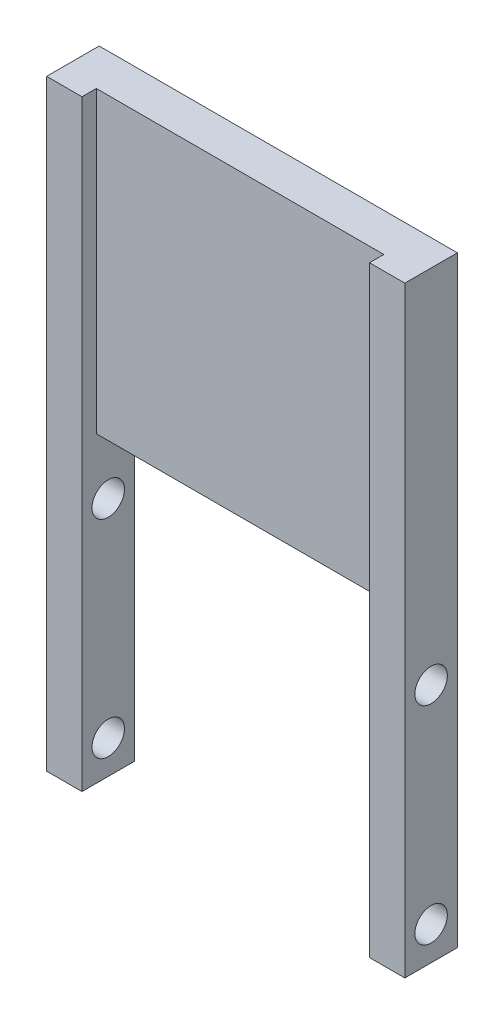
ISO-10303-21;
HEADER;
FILE_DESCRIPTION(('STEP AP214'),'2;1');
FILE_NAME('part.step','',(''),(''),'','','');
FILE_SCHEMA(('AUTOMOTIVE_DESIGN { 1 0 10303 214 1 1 1 1 }'));
ENDSEC;
DATA;
#1=APPLICATION_CONTEXT('core data for automotive mechanical design processes');
#2=APPLICATION_PROTOCOL_DEFINITION('international standard','automotive_design',2000,#1);
#3=PRODUCT_CONTEXT('',#1,'mechanical');
#4=PRODUCT('Part','Part','',(#3));
#5=PRODUCT_RELATED_PRODUCT_CATEGORY('part','',(#4));
#6=PRODUCT_DEFINITION_FORMATION('','',#4);
#7=PRODUCT_DEFINITION_CONTEXT('part definition',#1,'design');
#8=PRODUCT_DEFINITION('design','',#6,#7);
#9=PRODUCT_DEFINITION_SHAPE('','',#8);
#10=(LENGTH_UNIT() NAMED_UNIT(*) SI_UNIT(.MILLI.,.METRE.));
#11=(NAMED_UNIT(*) PLANE_ANGLE_UNIT() SI_UNIT($,.RADIAN.));
#12=(NAMED_UNIT(*) SI_UNIT($,.STERADIAN.) SOLID_ANGLE_UNIT());
#13=UNCERTAINTY_MEASURE_WITH_UNIT(LENGTH_MEASURE(1.E-05),#10,'distance_accuracy_value','');
#14=(GEOMETRIC_REPRESENTATION_CONTEXT(3) GLOBAL_UNCERTAINTY_ASSIGNED_CONTEXT((#13)) GLOBAL_UNIT_ASSIGNED_CONTEXT((#10,
#11,#12)) REPRESENTATION_CONTEXT('',''));
#15=CARTESIAN_POINT('',(0.,0.,0.));
#16=DIRECTION('',(0.,0.,1.));
#17=DIRECTION('',(1.,0.,0.));
#18=AXIS2_PLACEMENT_3D('',#15,#16,#17);
#19=CARTESIAN_POINT('',(0.,0.,0.));
#20=DIRECTION('',(0.,0.,-1.));
#21=DIRECTION('',(-1.,0.,0.));
#22=AXIS2_PLACEMENT_3D('',#19,#20,#21);
#23=PLANE('',#22);
#24=DIRECTION('',(0.,1.,0.));
#25=VECTOR('',#24,1.);
#26=CARTESIAN_POINT('',(3.7,0.,0.));
#27=LINE('',#26,#25);
#28=CARTESIAN_POINT('',(3.7,0.,0.));
#29=VERTEX_POINT('',#28);
#30=CARTESIAN_POINT('',(3.7,63.,0.));
#31=VERTEX_POINT('',#30);
#32=EDGE_CURVE('E144',#29,#31,#27,.T.);
#33=ORIENTED_EDGE('',*,*,#32,.T.);
#34=DIRECTION('',(-1.,0.,0.));
#35=VECTOR('',#34,1.);
#36=CARTESIAN_POINT('',(0.,63.,0.));
#37=LINE('',#36,#35);
#38=CARTESIAN_POINT('',(0.,63.,0.));
#39=VERTEX_POINT('',#38);
#40=EDGE_CURVE('E85',#31,#39,#37,.T.);
#41=ORIENTED_EDGE('',*,*,#40,.T.);
#42=DIRECTION('',(0.,-1.,0.));
#43=VECTOR('',#42,1.);
#44=CARTESIAN_POINT('',(0.,0.,0.));
#45=LINE('',#44,#43);
#46=CARTESIAN_POINT('',(0.,0.,0.));
#47=VERTEX_POINT('',#46);
#48=EDGE_CURVE('E138',#39,#47,#45,.T.);
#49=ORIENTED_EDGE('',*,*,#48,.T.);
#50=DIRECTION('',(1.,0.,0.));
#51=VECTOR('',#50,1.);
#52=CARTESIAN_POINT('',(0.,0.,0.));
#53=LINE('',#52,#51);
#54=EDGE_CURVE('E140',#47,#29,#53,.T.);
#55=ORIENTED_EDGE('',*,*,#54,.T.);
#56=EDGE_LOOP('',(#33,#41,#49,#55));
#57=FACE_BOUND('',#56,.T.);
#58=ADVANCED_FACE('F37',(#57),#23,.F.);
#59=CARTESIAN_POINT('',(0.,0.,-5.5));
#60=DIRECTION('',(-1.,0.,0.));
#61=DIRECTION('',(0.,0.,1.));
#62=AXIS2_PLACEMENT_3D('',#59,#60,#61);
#63=PLANE('',#62);
#64=CARTESIAN_POINT('',(0.,3.5,-2.75));
#65=DIRECTION('',(1.,0.,0.));
#66=DIRECTION('',(0.,0.,-1.));
#67=AXIS2_PLACEMENT_3D('',#64,#65,#66);
#68=CIRCLE('',#67,1.7);
#69=CARTESIAN_POINT('',(0.,3.5,-4.45));
#70=VERTEX_POINT('',#69);
#71=EDGE_CURVE('E169',#70,#70,#68,.T.);
#72=ORIENTED_EDGE('',*,*,#71,.T.);
#73=EDGE_LOOP('',(#72));
#74=FACE_BOUND('',#73,.T.);
#75=CARTESIAN_POINT('',(0.,25.2,-2.75));
#76=DIRECTION('',(1.,0.,0.));
#77=DIRECTION('',(0.,0.,-1.));
#78=AXIS2_PLACEMENT_3D('',#75,#76,#77);
#79=CIRCLE('',#78,1.7);
#80=CARTESIAN_POINT('',(0.,25.2,-4.45));
#81=VERTEX_POINT('',#80);
#82=EDGE_CURVE('E180',#81,#81,#79,.T.);
#83=ORIENTED_EDGE('',*,*,#82,.T.);
#84=EDGE_LOOP('',(#83));
#85=FACE_BOUND('',#84,.T.);
#86=ORIENTED_EDGE('',*,*,#48,.F.);
#87=DIRECTION('',(0.,0.,1.));
#88=VECTOR('',#87,1.);
#89=CARTESIAN_POINT('',(0.,63.,-5.5));
#90=LINE('',#89,#88);
#91=CARTESIAN_POINT('',(0.,63.,-5.5));
#92=VERTEX_POINT('',#91);
#93=EDGE_CURVE('E11',#92,#39,#90,.T.);
#94=ORIENTED_EDGE('',*,*,#93,.F.);
#95=DIRECTION('',(0.,-1.,0.));
#96=VECTOR('',#95,1.);
#97=CARTESIAN_POINT('',(0.,0.,-5.5));
#98=LINE('',#97,#96);
#99=CARTESIAN_POINT('',(0.,0.,-5.5));
#100=VERTEX_POINT('',#99);
#101=EDGE_CURVE('E154',#92,#100,#98,.T.);
#102=ORIENTED_EDGE('',*,*,#101,.T.);
#103=DIRECTION('',(0.,0.,1.));
#104=VECTOR('',#103,1.);
#105=CARTESIAN_POINT('',(0.,0.,-5.5));
#106=LINE('',#105,#104);
#107=EDGE_CURVE('E92',#100,#47,#106,.T.);
#108=ORIENTED_EDGE('',*,*,#107,.T.);
#109=EDGE_LOOP('',(#86,#94,#102,#108));
#110=FACE_BOUND('',#109,.T.);
#111=ADVANCED_FACE('F39',(#74,#85,#110),#63,.T.);
#112=CARTESIAN_POINT('',(0.,63.,-5.5));
#113=DIRECTION('',(0.,1.,0.));
#114=DIRECTION('',(0.,0.,1.));
#115=AXIS2_PLACEMENT_3D('',#112,#113,#114);
#116=PLANE('',#115);
#117=DIRECTION('',(0.,0.,1.));
#118=VECTOR('',#117,1.);
#119=CARTESIAN_POINT('',(3.7,63.,-1.5));
#120=LINE('',#119,#118);
#121=CARTESIAN_POINT('',(3.7,63.,-1.5));
#122=VERTEX_POINT('',#121);
#123=EDGE_CURVE('E141',#122,#31,#120,.T.);
#124=ORIENTED_EDGE('',*,*,#123,.F.);
#125=DIRECTION('',(-1.,0.,0.));
#126=VECTOR('',#125,1.);
#127=CARTESIAN_POINT('',(3.7,63.,-1.5));
#128=LINE('',#127,#126);
#129=CARTESIAN_POINT('',(33.8,63.,-1.5));
#130=VERTEX_POINT('',#129);
#131=EDGE_CURVE('E200',#130,#122,#128,.T.);
#132=ORIENTED_EDGE('',*,*,#131,.F.);
#133=DIRECTION('',(0.,0.,1.));
#134=VECTOR('',#133,1.);
#135=CARTESIAN_POINT('',(33.8,63.,-1.5));
#136=LINE('',#135,#134);
#137=CARTESIAN_POINT('',(33.8,63.,0.));
#138=VERTEX_POINT('',#137);
#139=EDGE_CURVE('E203',#130,#138,#136,.T.);
#140=ORIENTED_EDGE('',*,*,#139,.T.);
#141=CARTESIAN_POINT('',(37.5,63.,0.));
#142=VERTEX_POINT('',#141);
#143=EDGE_CURVE('E152',#142,#138,#37,.T.);
#144=ORIENTED_EDGE('',*,*,#143,.F.);
#145=DIRECTION('',(0.,0.,1.));
#146=VECTOR('',#145,1.);
#147=CARTESIAN_POINT('',(37.5,63.,-5.5));
#148=LINE('',#147,#146);
#149=CARTESIAN_POINT('',(37.5,63.,-5.5));
#150=VERTEX_POINT('',#149);
#151=EDGE_CURVE('E47',#150,#142,#148,.T.);
#152=ORIENTED_EDGE('',*,*,#151,.F.);
#153=DIRECTION('',(-1.,0.,0.));
#154=VECTOR('',#153,1.);
#155=CARTESIAN_POINT('',(0.,63.,-5.5));
#156=LINE('',#155,#154);
#157=EDGE_CURVE('E128',#150,#92,#156,.T.);
#158=ORIENTED_EDGE('',*,*,#157,.T.);
#159=ORIENTED_EDGE('',*,*,#93,.T.);
#160=ORIENTED_EDGE('',*,*,#40,.F.);
#161=EDGE_LOOP('',(#124,#132,#140,#144,#152,#158,#159,#160));
#162=FACE_BOUND('',#161,.T.);
#163=ADVANCED_FACE('F230',(#162),#116,.T.);
#164=CARTESIAN_POINT('',(37.5,0.,-5.5));
#165=DIRECTION('',(1.,0.,0.));
#166=DIRECTION('',(0.,0.,-1.));
#167=AXIS2_PLACEMENT_3D('',#164,#165,#166);
#168=PLANE('',#167);
#169=CARTESIAN_POINT('',(37.5,3.5,-2.75));
#170=DIRECTION('',(1.,0.,0.));
#171=DIRECTION('',(0.,0.,-1.));
#172=AXIS2_PLACEMENT_3D('',#169,#170,#171);
#173=CIRCLE('',#172,1.7);
#174=CARTESIAN_POINT('',(37.5,3.5,-4.45));
#175=VERTEX_POINT('',#174);
#176=EDGE_CURVE('E175',#175,#175,#173,.T.);
#177=ORIENTED_EDGE('',*,*,#176,.F.);
#178=EDGE_LOOP('',(#177));
#179=FACE_BOUND('',#178,.T.);
#180=CARTESIAN_POINT('',(37.5,25.2,-2.75));
#181=DIRECTION('',(1.,0.,0.));
#182=DIRECTION('',(0.,0.,-1.));
#183=AXIS2_PLACEMENT_3D('',#180,#181,#182);
#184=CIRCLE('',#183,1.7);
#185=CARTESIAN_POINT('',(37.5,25.2,-4.45));
#186=VERTEX_POINT('',#185);
#187=EDGE_CURVE('E185',#186,#186,#184,.T.);
#188=ORIENTED_EDGE('',*,*,#187,.F.);
#189=EDGE_LOOP('',(#188));
#190=FACE_BOUND('',#189,.T.);
#191=DIRECTION('',(0.,1.,0.));
#192=VECTOR('',#191,1.);
#193=CARTESIAN_POINT('',(37.5,0.,0.));
#194=LINE('',#193,#192);
#195=CARTESIAN_POINT('',(37.5,0.,0.));
#196=VERTEX_POINT('',#195);
#197=EDGE_CURVE('E114',#196,#142,#194,.T.);
#198=ORIENTED_EDGE('',*,*,#197,.F.);
#199=DIRECTION('',(0.,0.,1.));
#200=VECTOR('',#199,1.);
#201=CARTESIAN_POINT('',(37.5,0.,-5.5));
#202=LINE('',#201,#200);
#203=CARTESIAN_POINT('',(37.5,0.,-5.5));
#204=VERTEX_POINT('',#203);
#205=EDGE_CURVE('E109',#204,#196,#202,.T.);
#206=ORIENTED_EDGE('',*,*,#205,.F.);
#207=DIRECTION('',(0.,1.,0.));
#208=VECTOR('',#207,1.);
#209=CARTESIAN_POINT('',(37.5,0.,-5.5));
#210=LINE('',#209,#208);
#211=EDGE_CURVE('E112',#204,#150,#210,.T.);
#212=ORIENTED_EDGE('',*,*,#211,.T.);
#213=ORIENTED_EDGE('',*,*,#151,.T.);
#214=EDGE_LOOP('',(#198,#206,#212,#213));
#215=FACE_BOUND('',#214,.T.);
#216=ADVANCED_FACE('F111',(#179,#190,#215),#168,.T.);
#217=CARTESIAN_POINT('',(33.8,0.,-5.5));
#218=DIRECTION('',(0.,-1.,0.));
#219=DIRECTION('',(0.,0.,-1.));
#220=AXIS2_PLACEMENT_3D('',#217,#218,#219);
#221=PLANE('',#220);
#222=DIRECTION('',(1.,0.,0.));
#223=VECTOR('',#222,1.);
#224=CARTESIAN_POINT('',(33.8,0.,0.));
#225=LINE('',#224,#223);
#226=CARTESIAN_POINT('',(33.8,0.,0.));
#227=VERTEX_POINT('',#226);
#228=EDGE_CURVE('E149',#227,#196,#225,.T.);
#229=ORIENTED_EDGE('',*,*,#228,.F.);
#230=DIRECTION('',(0.,0.,1.));
#231=VECTOR('',#230,1.);
#232=CARTESIAN_POINT('',(33.8,0.,-5.5));
#233=LINE('',#232,#231);
#234=CARTESIAN_POINT('',(33.8,0.,-5.5));
#235=VERTEX_POINT('',#234);
#236=EDGE_CURVE('E119',#235,#227,#233,.T.);
#237=ORIENTED_EDGE('',*,*,#236,.F.);
#238=DIRECTION('',(1.,0.,0.));
#239=VECTOR('',#238,1.);
#240=CARTESIAN_POINT('',(33.8,0.,-5.5));
#241=LINE('',#240,#239);
#242=EDGE_CURVE('E125',#235,#204,#241,.T.);
#243=ORIENTED_EDGE('',*,*,#242,.T.);
#244=ORIENTED_EDGE('',*,*,#205,.T.);
#245=EDGE_LOOP('',(#229,#237,#243,#244));
#246=FACE_BOUND('',#245,.T.);
#247=ADVANCED_FACE('F130',(#246),#221,.T.);
#248=CARTESIAN_POINT('',(33.8,0.,-5.5));
#249=DIRECTION('',(-1.,0.,0.));
#250=DIRECTION('',(0.,0.,1.));
#251=AXIS2_PLACEMENT_3D('',#248,#249,#250);
#252=PLANE('',#251);
#253=CARTESIAN_POINT('',(33.8,3.5,-2.75));
#254=DIRECTION('',(-1.,0.,0.));
#255=DIRECTION('',(0.,0.,1.));
#256=AXIS2_PLACEMENT_3D('',#253,#254,#255);
#257=CIRCLE('',#256,1.7);
#258=CARTESIAN_POINT('',(33.8,3.5,-1.05));
#259=VERTEX_POINT('',#258);
#260=EDGE_CURVE('E188',#259,#259,#257,.T.);
#261=ORIENTED_EDGE('',*,*,#260,.F.);
#262=EDGE_LOOP('',(#261));
#263=FACE_BOUND('',#262,.T.);
#264=CARTESIAN_POINT('',(33.8,25.2,-2.75));
#265=DIRECTION('',(-1.,0.,0.));
#266=DIRECTION('',(0.,0.,1.));
#267=AXIS2_PLACEMENT_3D('',#264,#265,#266);
#268=CIRCLE('',#267,1.7);
#269=CARTESIAN_POINT('',(33.8,25.2,-1.05));
#270=VERTEX_POINT('',#269);
#271=EDGE_CURVE('E168',#270,#270,#268,.T.);
#272=ORIENTED_EDGE('',*,*,#271,.F.);
#273=EDGE_LOOP('',(#272));
#274=FACE_BOUND('',#273,.T.);
#275=DIRECTION('',(0.,-1.,0.));
#276=VECTOR('',#275,1.);
#277=CARTESIAN_POINT('',(33.8,0.,0.));
#278=LINE('',#277,#276);
#279=EDGE_CURVE('E146',#138,#227,#278,.T.);
#280=ORIENTED_EDGE('',*,*,#279,.F.);
#281=ORIENTED_EDGE('',*,*,#139,.F.);
#282=DIRECTION('',(0.,1.,0.));
#283=VECTOR('',#282,1.);
#284=CARTESIAN_POINT('',(33.8,31.7,-1.5));
#285=LINE('',#284,#283);
#286=CARTESIAN_POINT('',(33.8,31.7,-1.5));
#287=VERTEX_POINT('',#286);
#288=EDGE_CURVE('E197',#287,#130,#285,.T.);
#289=ORIENTED_EDGE('',*,*,#288,.F.);
#290=DIRECTION('',(0.,0.,1.));
#291=VECTOR('',#290,1.);
#292=CARTESIAN_POINT('',(33.8,31.7,-5.5));
#293=LINE('',#292,#291);
#294=CARTESIAN_POINT('',(33.8,31.7,-5.5));
#295=VERTEX_POINT('',#294);
#296=EDGE_CURVE('E158',#295,#287,#293,.T.);
#297=ORIENTED_EDGE('',*,*,#296,.F.);
#298=DIRECTION('',(0.,-1.,0.));
#299=VECTOR('',#298,1.);
#300=CARTESIAN_POINT('',(33.8,0.,-5.5));
#301=LINE('',#300,#299);
#302=EDGE_CURVE('E131',#295,#235,#301,.T.);
#303=ORIENTED_EDGE('',*,*,#302,.T.);
#304=ORIENTED_EDGE('',*,*,#236,.T.);
#305=EDGE_LOOP('',(#280,#281,#289,#297,#303,#304));
#306=FACE_BOUND('',#305,.T.);
#307=ADVANCED_FACE('F245',(#263,#274,#306),#252,.T.);
#308=CARTESIAN_POINT('',(3.7,31.7,-5.5));
#309=DIRECTION('',(0.,-1.,0.));
#310=DIRECTION('',(0.,0.,-1.));
#311=AXIS2_PLACEMENT_3D('',#308,#309,#310);
#312=PLANE('',#311);
#313=DIRECTION('',(1.,0.,0.));
#314=VECTOR('',#313,1.);
#315=CARTESIAN_POINT('',(3.7,31.7,-1.5));
#316=LINE('',#315,#314);
#317=CARTESIAN_POINT('',(3.7,31.7,-1.5));
#318=VERTEX_POINT('',#317);
#319=EDGE_CURVE('E194',#318,#287,#316,.T.);
#320=ORIENTED_EDGE('',*,*,#319,.F.);
#321=DIRECTION('',(0.,0.,1.));
#322=VECTOR('',#321,1.);
#323=CARTESIAN_POINT('',(3.7,31.7,-5.5));
#324=LINE('',#323,#322);
#325=CARTESIAN_POINT('',(3.7,31.7,-5.5));
#326=VERTEX_POINT('',#325);
#327=EDGE_CURVE('E161',#326,#318,#324,.T.);
#328=ORIENTED_EDGE('',*,*,#327,.F.);
#329=DIRECTION('',(1.,0.,0.));
#330=VECTOR('',#329,1.);
#331=CARTESIAN_POINT('',(3.7,31.7,-5.5));
#332=LINE('',#331,#330);
#333=EDGE_CURVE('E133',#326,#295,#332,.T.);
#334=ORIENTED_EDGE('',*,*,#333,.T.);
#335=ORIENTED_EDGE('',*,*,#296,.T.);
#336=EDGE_LOOP('',(#320,#328,#334,#335));
#337=FACE_BOUND('',#336,.T.);
#338=ADVANCED_FACE('F217',(#337),#312,.T.);
#339=CARTESIAN_POINT('',(3.7,0.,-5.5));
#340=DIRECTION('',(1.,0.,0.));
#341=DIRECTION('',(0.,0.,-1.));
#342=AXIS2_PLACEMENT_3D('',#339,#340,#341);
#343=PLANE('',#342);
#344=CARTESIAN_POINT('',(3.7,3.5,-2.75));
#345=DIRECTION('',(1.,0.,0.));
#346=DIRECTION('',(0.,0.,-1.));
#347=AXIS2_PLACEMENT_3D('',#344,#345,#346);
#348=CIRCLE('',#347,1.7);
#349=CARTESIAN_POINT('',(3.7,3.5,-4.45));
#350=VERTEX_POINT('',#349);
#351=EDGE_CURVE('E41',#350,#350,#348,.T.);
#352=ORIENTED_EDGE('',*,*,#351,.F.);
#353=EDGE_LOOP('',(#352));
#354=FACE_BOUND('',#353,.T.);
#355=CARTESIAN_POINT('',(3.7,25.2,-2.75));
#356=DIRECTION('',(1.,0.,0.));
#357=DIRECTION('',(0.,0.,-1.));
#358=AXIS2_PLACEMENT_3D('',#355,#356,#357);
#359=CIRCLE('',#358,1.7);
#360=CARTESIAN_POINT('',(3.7,25.2,-4.45));
#361=VERTEX_POINT('',#360);
#362=EDGE_CURVE('E166',#361,#361,#359,.T.);
#363=ORIENTED_EDGE('',*,*,#362,.F.);
#364=EDGE_LOOP('',(#363));
#365=FACE_BOUND('',#364,.T.);
#366=ORIENTED_EDGE('',*,*,#32,.F.);
#367=DIRECTION('',(0.,0.,1.));
#368=VECTOR('',#367,1.);
#369=CARTESIAN_POINT('',(3.7,0.,-5.5));
#370=LINE('',#369,#368);
#371=CARTESIAN_POINT('',(3.7,0.,-5.5));
#372=VERTEX_POINT('',#371);
#373=EDGE_CURVE('E164',#372,#29,#370,.T.);
#374=ORIENTED_EDGE('',*,*,#373,.F.);
#375=DIRECTION('',(0.,1.,0.));
#376=VECTOR('',#375,1.);
#377=CARTESIAN_POINT('',(3.7,0.,-5.5));
#378=LINE('',#377,#376);
#379=EDGE_CURVE('E211',#372,#326,#378,.T.);
#380=ORIENTED_EDGE('',*,*,#379,.T.);
#381=ORIENTED_EDGE('',*,*,#327,.T.);
#382=DIRECTION('',(0.,-1.,0.));
#383=VECTOR('',#382,1.);
#384=CARTESIAN_POINT('',(3.7,31.7,-1.5));
#385=LINE('',#384,#383);
#386=EDGE_CURVE('E191',#122,#318,#385,.T.);
#387=ORIENTED_EDGE('',*,*,#386,.F.);
#388=ORIENTED_EDGE('',*,*,#123,.T.);
#389=EDGE_LOOP('',(#366,#374,#380,#381,#387,#388));
#390=FACE_BOUND('',#389,.T.);
#391=ADVANCED_FACE('F222',(#354,#365,#390),#343,.T.);
#392=CARTESIAN_POINT('',(0.,0.,-5.5));
#393=DIRECTION('',(0.,-1.,0.));
#394=DIRECTION('',(0.,0.,-1.));
#395=AXIS2_PLACEMENT_3D('',#392,#393,#394);
#396=PLANE('',#395);
#397=ORIENTED_EDGE('',*,*,#54,.F.);
#398=ORIENTED_EDGE('',*,*,#107,.F.);
#399=DIRECTION('',(1.,0.,0.));
#400=VECTOR('',#399,1.);
#401=CARTESIAN_POINT('',(0.,0.,-5.5));
#402=LINE('',#401,#400);
#403=EDGE_CURVE('E209',#100,#372,#402,.T.);
#404=ORIENTED_EDGE('',*,*,#403,.T.);
#405=ORIENTED_EDGE('',*,*,#373,.T.);
#406=EDGE_LOOP('',(#397,#398,#404,#405));
#407=FACE_BOUND('',#406,.T.);
#408=ADVANCED_FACE('F225',(#407),#396,.T.);
#409=CARTESIAN_POINT('',(0.,0.,-5.5));
#410=DIRECTION('',(0.,0.,-1.));
#411=DIRECTION('',(-1.,0.,0.));
#412=AXIS2_PLACEMENT_3D('',#409,#410,#411);
#413=PLANE('',#412);
#414=ORIENTED_EDGE('',*,*,#101,.F.);
#415=ORIENTED_EDGE('',*,*,#157,.F.);
#416=ORIENTED_EDGE('',*,*,#211,.F.);
#417=ORIENTED_EDGE('',*,*,#242,.F.);
#418=ORIENTED_EDGE('',*,*,#302,.F.);
#419=ORIENTED_EDGE('',*,*,#333,.F.);
#420=ORIENTED_EDGE('',*,*,#379,.F.);
#421=ORIENTED_EDGE('',*,*,#403,.F.);
#422=EDGE_LOOP('',(#414,#415,#416,#417,#418,#419,#420,#421));
#423=FACE_BOUND('',#422,.T.);
#424=ADVANCED_FACE('F123',(#423),#413,.T.);
#425=ORIENTED_EDGE('',*,*,#143,.T.);
#426=ORIENTED_EDGE('',*,*,#279,.T.);
#427=ORIENTED_EDGE('',*,*,#228,.T.);
#428=ORIENTED_EDGE('',*,*,#197,.T.);
#429=EDGE_LOOP('',(#425,#426,#427,#428));
#430=FACE_BOUND('',#429,.T.);
#431=ADVANCED_FACE('F234',(#430),#23,.F.);
#432=CARTESIAN_POINT('',(0.,0.,-1.5));
#433=DIRECTION('',(0.,0.,-1.));
#434=DIRECTION('',(-1.,0.,0.));
#435=AXIS2_PLACEMENT_3D('',#432,#433,#434);
#436=PLANE('',#435);
#437=ORIENTED_EDGE('',*,*,#386,.T.);
#438=ORIENTED_EDGE('',*,*,#319,.T.);
#439=ORIENTED_EDGE('',*,*,#288,.T.);
#440=ORIENTED_EDGE('',*,*,#131,.T.);
#441=EDGE_LOOP('',(#437,#438,#439,#440));
#442=FACE_BOUND('',#441,.T.);
#443=ADVANCED_FACE('F244',(#442),#436,.F.);
#444=CARTESIAN_POINT('',(0.,25.2,-2.75));
#445=DIRECTION('',(1.,0.,0.));
#446=DIRECTION('',(0.,0.,-1.));
#447=AXIS2_PLACEMENT_3D('',#444,#445,#446);
#448=CYLINDRICAL_SURFACE('',#447,1.7);
#449=ORIENTED_EDGE('',*,*,#362,.T.);
#450=EDGE_LOOP('',(#449));
#451=FACE_BOUND('',#450,.T.);
#452=ORIENTED_EDGE('',*,*,#82,.F.);
#453=EDGE_LOOP('',(#452));
#454=FACE_BOUND('',#453,.T.);
#455=ADVANCED_FACE('F269',(#451,#454),#448,.F.);
#456=CARTESIAN_POINT('',(0.,3.5,-2.75));
#457=DIRECTION('',(1.,0.,0.));
#458=DIRECTION('',(0.,0.,-1.));
#459=AXIS2_PLACEMENT_3D('',#456,#457,#458);
#460=CYLINDRICAL_SURFACE('',#459,1.7);
#461=ORIENTED_EDGE('',*,*,#351,.T.);
#462=EDGE_LOOP('',(#461));
#463=FACE_BOUND('',#462,.T.);
#464=ORIENTED_EDGE('',*,*,#71,.F.);
#465=EDGE_LOOP('',(#464));
#466=FACE_BOUND('',#465,.T.);
#467=ADVANCED_FACE('F277',(#463,#466),#460,.F.);
#468=ORIENTED_EDGE('',*,*,#271,.T.);
#469=EDGE_LOOP('',(#468));
#470=FACE_BOUND('',#469,.T.);
#471=ORIENTED_EDGE('',*,*,#187,.T.);
#472=EDGE_LOOP('',(#471));
#473=FACE_BOUND('',#472,.T.);
#474=ADVANCED_FACE('F278',(#470,#473),#448,.F.);
#475=ORIENTED_EDGE('',*,*,#260,.T.);
#476=EDGE_LOOP('',(#475));
#477=FACE_BOUND('',#476,.T.);
#478=ORIENTED_EDGE('',*,*,#176,.T.);
#479=EDGE_LOOP('',(#478));
#480=FACE_BOUND('',#479,.T.);
#481=ADVANCED_FACE('F281',(#477,#480),#460,.F.);
#482=CLOSED_SHELL('',(#58,#111,#163,#216,#247,#307,#338,#391,#408,#424,#431,#443,#455,#467,#474,#481));
#483=MANIFOLD_SOLID_BREP('B2',#482);
#484=ADVANCED_BREP_SHAPE_REPRESENTATION('',(#18,#483),#14);
#485=SHAPE_DEFINITION_REPRESENTATION(#9,#484);
ENDSEC;
END-ISO-10303-21;
